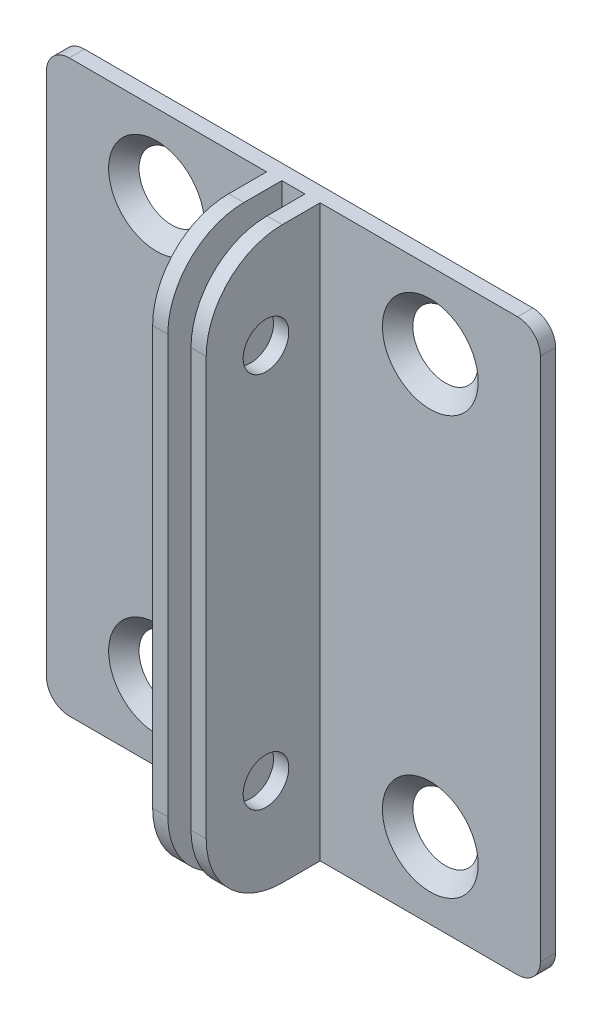
ISO-10303-21;
HEADER;
FILE_DESCRIPTION(('STEP AP214'),'2;1');
FILE_NAME('part.step','',(''),(''),'','','');
FILE_SCHEMA(('AUTOMOTIVE_DESIGN { 1 0 10303 214 1 1 1 1 }'));
ENDSEC;
DATA;
#1=APPLICATION_CONTEXT('core data for automotive mechanical design processes');
#2=APPLICATION_PROTOCOL_DEFINITION('international standard','automotive_design',2000,#1);
#3=PRODUCT_CONTEXT('',#1,'mechanical');
#4=PRODUCT('Part','Part','',(#3));
#5=PRODUCT_RELATED_PRODUCT_CATEGORY('part','',(#4));
#6=PRODUCT_DEFINITION_FORMATION('','',#4);
#7=PRODUCT_DEFINITION_CONTEXT('part definition',#1,'design');
#8=PRODUCT_DEFINITION('design','',#6,#7);
#9=PRODUCT_DEFINITION_SHAPE('','',#8);
#10=(LENGTH_UNIT() NAMED_UNIT(*) SI_UNIT(.MILLI.,.METRE.));
#11=(NAMED_UNIT(*) PLANE_ANGLE_UNIT() SI_UNIT($,.RADIAN.));
#12=(NAMED_UNIT(*) SI_UNIT($,.STERADIAN.) SOLID_ANGLE_UNIT());
#13=UNCERTAINTY_MEASURE_WITH_UNIT(LENGTH_MEASURE(1.E-05),#10,'distance_accuracy_value','');
#14=(GEOMETRIC_REPRESENTATION_CONTEXT(3) GLOBAL_UNCERTAINTY_ASSIGNED_CONTEXT((#13)) GLOBAL_UNIT_ASSIGNED_CONTEXT((#10,
#11,#12)) REPRESENTATION_CONTEXT('',''));
#15=CARTESIAN_POINT('',(0.,0.,0.));
#16=DIRECTION('',(0.,0.,1.));
#17=DIRECTION('',(1.,0.,0.));
#18=AXIS2_PLACEMENT_3D('',#15,#16,#17);
#19=CARTESIAN_POINT('',(0.,0.,0.));
#20=DIRECTION('',(0.,0.,-1.));
#21=DIRECTION('',(-1.,0.,0.));
#22=AXIS2_PLACEMENT_3D('',#19,#20,#21);
#23=PLANE('',#22);
#24=CARTESIAN_POINT('',(14.4883937482752,65.,0.));
#25=DIRECTION('',(0.,0.,-1.));
#26=DIRECTION('',(-1.,0.,0.));
#27=AXIS2_PLACEMENT_3D('',#24,#25,#26);
#28=CIRCLE('',#27,4.3);
#29=CARTESIAN_POINT('',(10.1883937482752,65.,0.));
#30=VERTEX_POINT('',#29);
#31=EDGE_CURVE('E350',#30,#30,#28,.T.);
#32=ORIENTED_EDGE('',*,*,#31,.F.);
#33=EDGE_LOOP('',(#32));
#34=FACE_BOUND('',#33,.T.);
#35=CARTESIAN_POINT('',(14.4883937482752,9.99999999999999,0.));
#36=DIRECTION('',(0.,0.,-1.));
#37=DIRECTION('',(-1.,0.,0.));
#38=AXIS2_PLACEMENT_3D('',#35,#36,#37);
#39=CIRCLE('',#38,4.3);
#40=CARTESIAN_POINT('',(10.1883937482752,9.99999999999999,0.));
#41=VERTEX_POINT('',#40);
#42=EDGE_CURVE('E255',#41,#41,#39,.T.);
#43=ORIENTED_EDGE('',*,*,#42,.F.);
#44=EDGE_LOOP('',(#43));
#45=FACE_BOUND('',#44,.T.);
#46=CARTESIAN_POINT('',(50.5116062517248,65.,0.));
#47=DIRECTION('',(0.,0.,-1.));
#48=DIRECTION('',(-1.,0.,0.));
#49=AXIS2_PLACEMENT_3D('',#46,#47,#48);
#50=CIRCLE('',#49,4.3);
#51=CARTESIAN_POINT('',(46.2116062517248,65.,0.));
#52=VERTEX_POINT('',#51);
#53=EDGE_CURVE('E318',#52,#52,#50,.T.);
#54=ORIENTED_EDGE('',*,*,#53,.F.);
#55=EDGE_LOOP('',(#54));
#56=FACE_BOUND('',#55,.T.);
#57=DIRECTION('',(0.,1.,0.));
#58=VECTOR('',#57,1.);
#59=CARTESIAN_POINT('',(65.,0.,0.));
#60=LINE('',#59,#58);
#61=CARTESIAN_POINT('',(65.,3.,0.));
#62=VERTEX_POINT('',#61);
#63=CARTESIAN_POINT('',(65.,72.,0.));
#64=VERTEX_POINT('',#63);
#65=EDGE_CURVE('E264',#62,#64,#60,.T.);
#66=ORIENTED_EDGE('',*,*,#65,.F.);
#67=CARTESIAN_POINT('',(62.,3.,0.));
#68=DIRECTION('',(0.,0.,-1.));
#69=DIRECTION('',(-1.,0.,0.));
#70=AXIS2_PLACEMENT_3D('',#67,#68,#69);
#71=CIRCLE('',#70,3.);
#72=CARTESIAN_POINT('',(62.,0.,0.));
#73=VERTEX_POINT('',#72);
#74=EDGE_CURVE('E252',#62,#73,#71,.T.);
#75=ORIENTED_EDGE('',*,*,#74,.T.);
#76=DIRECTION('',(1.,0.,0.));
#77=VECTOR('',#76,1.);
#78=CARTESIAN_POINT('',(0.,0.,0.));
#79=LINE('',#78,#77);
#80=CARTESIAN_POINT('',(3.,0.,0.));
#81=VERTEX_POINT('',#80);
#82=EDGE_CURVE('E248',#81,#73,#79,.T.);
#83=ORIENTED_EDGE('',*,*,#82,.F.);
#84=CARTESIAN_POINT('',(3.,3.,0.));
#85=DIRECTION('',(0.,0.,-1.));
#86=DIRECTION('',(-1.,0.,0.));
#87=AXIS2_PLACEMENT_3D('',#84,#85,#86);
#88=CIRCLE('',#87,3.);
#89=CARTESIAN_POINT('',(0.,3.,0.));
#90=VERTEX_POINT('',#89);
#91=EDGE_CURVE('E254',#81,#90,#88,.T.);
#92=ORIENTED_EDGE('',*,*,#91,.T.);
#93=DIRECTION('',(0.,-1.,0.));
#94=VECTOR('',#93,1.);
#95=CARTESIAN_POINT('',(0.,0.,0.));
#96=LINE('',#95,#94);
#97=CARTESIAN_POINT('',(0.,72.,0.));
#98=VERTEX_POINT('',#97);
#99=EDGE_CURVE('E233',#98,#90,#96,.T.);
#100=ORIENTED_EDGE('',*,*,#99,.F.);
#101=CARTESIAN_POINT('',(3.,72.,0.));
#102=DIRECTION('',(0.,0.,-1.));
#103=DIRECTION('',(-1.,0.,0.));
#104=AXIS2_PLACEMENT_3D('',#101,#102,#103);
#105=CIRCLE('',#104,3.);
#106=CARTESIAN_POINT('',(3.,75.,0.));
#107=VERTEX_POINT('',#106);
#108=EDGE_CURVE('E259',#98,#107,#105,.T.);
#109=ORIENTED_EDGE('',*,*,#108,.T.);
#110=DIRECTION('',(-1.,0.,0.));
#111=VECTOR('',#110,1.);
#112=CARTESIAN_POINT('',(0.,75.,0.));
#113=LINE('',#112,#111);
#114=CARTESIAN_POINT('',(62.,75.,0.));
#115=VERTEX_POINT('',#114);
#116=EDGE_CURVE('E206',#115,#107,#113,.T.);
#117=ORIENTED_EDGE('',*,*,#116,.F.);
#118=CARTESIAN_POINT('',(62.,72.,0.));
#119=DIRECTION('',(0.,0.,-1.));
#120=DIRECTION('',(-1.,0.,0.));
#121=AXIS2_PLACEMENT_3D('',#118,#119,#120);
#122=CIRCLE('',#121,3.);
#123=EDGE_CURVE('E256',#115,#64,#122,.T.);
#124=ORIENTED_EDGE('',*,*,#123,.T.);
#125=EDGE_LOOP('',(#66,#75,#83,#92,#100,#109,#117,#124));
#126=FACE_BOUND('',#125,.T.);
#127=CARTESIAN_POINT('',(50.5116062517248,9.99999999999999,0.));
#128=DIRECTION('',(0.,0.,-1.));
#129=DIRECTION('',(-1.,0.,0.));
#130=AXIS2_PLACEMENT_3D('',#127,#128,#129);
#131=CIRCLE('',#130,4.3);
#132=CARTESIAN_POINT('',(46.2116062517248,9.99999999999999,0.));
#133=VERTEX_POINT('',#132);
#134=EDGE_CURVE('E47',#133,#133,#131,.T.);
#135=ORIENTED_EDGE('',*,*,#134,.F.);
#136=EDGE_LOOP('',(#135));
#137=FACE_BOUND('',#136,.T.);
#138=ADVANCED_FACE('F38',(#34,#45,#56,#126,#137),#23,.T.);
#139=CARTESIAN_POINT('',(0.,0.,2.));
#140=DIRECTION('',(0.,0.,-1.));
#141=DIRECTION('',(-1.,0.,0.));
#142=AXIS2_PLACEMENT_3D('',#139,#140,#141);
#143=PLANE('',#142);
#144=DIRECTION('',(0.,1.,0.));
#145=VECTOR('',#144,1.);
#146=CARTESIAN_POINT('',(30.9767874965503,75.,2.));
#147=LINE('',#146,#145);
#148=CARTESIAN_POINT('',(30.9767874965503,0.,2.));
#149=VERTEX_POINT('',#148);
#150=CARTESIAN_POINT('',(30.9767874965503,75.,2.));
#151=VERTEX_POINT('',#150);
#152=EDGE_CURVE('E303',#149,#151,#147,.T.);
#153=ORIENTED_EDGE('',*,*,#152,.F.);
#154=DIRECTION('',(1.,0.,0.));
#155=VECTOR('',#154,1.);
#156=CARTESIAN_POINT('',(0.,0.,2.));
#157=LINE('',#156,#155);
#158=CARTESIAN_POINT('',(34.0232125034497,0.,2.));
#159=VERTEX_POINT('',#158);
#160=EDGE_CURVE('E258',#149,#159,#157,.T.);
#161=ORIENTED_EDGE('',*,*,#160,.T.);
#162=DIRECTION('',(0.,-1.,0.));
#163=VECTOR('',#162,1.);
#164=CARTESIAN_POINT('',(34.0232125034497,75.,2.));
#165=LINE('',#164,#163);
#166=CARTESIAN_POINT('',(34.0232125034497,75.,2.));
#167=VERTEX_POINT('',#166);
#168=EDGE_CURVE('E197',#167,#159,#165,.T.);
#169=ORIENTED_EDGE('',*,*,#168,.F.);
#170=DIRECTION('',(-1.,0.,0.));
#171=VECTOR('',#170,1.);
#172=CARTESIAN_POINT('',(0.,75.,2.));
#173=LINE('',#172,#171);
#174=EDGE_CURVE('E277',#167,#151,#173,.T.);
#175=ORIENTED_EDGE('',*,*,#174,.T.);
#176=EDGE_LOOP('',(#153,#161,#169,#175));
#177=FACE_BOUND('',#176,.T.);
#178=ADVANCED_FACE('F440',(#177),#143,.F.);
#179=CARTESIAN_POINT('',(14.4883937482752,65.,2.));
#180=DIRECTION('',(0.,0.,1.));
#181=DIRECTION('',(1.,0.,0.));
#182=AXIS2_PLACEMENT_3D('',#179,#180,#181);
#183=CIRCLE('',#182,6.3);
#184=CARTESIAN_POINT('',(20.7883937482752,65.,2.));
#185=VERTEX_POINT('',#184);
#186=EDGE_CURVE('E347',#185,#185,#183,.T.);
#187=ORIENTED_EDGE('',*,*,#186,.F.);
#188=EDGE_LOOP('',(#187));
#189=FACE_BOUND('',#188,.T.);
#190=CARTESIAN_POINT('',(14.4883937482752,9.99999999999999,2.));
#191=DIRECTION('',(0.,0.,1.));
#192=DIRECTION('',(1.,0.,0.));
#193=AXIS2_PLACEMENT_3D('',#190,#191,#192);
#194=CIRCLE('',#193,6.3);
#195=CARTESIAN_POINT('',(20.7883937482752,9.99999999999999,2.));
#196=VERTEX_POINT('',#195);
#197=EDGE_CURVE('E321',#196,#196,#194,.T.);
#198=ORIENTED_EDGE('',*,*,#197,.F.);
#199=EDGE_LOOP('',(#198));
#200=FACE_BOUND('',#199,.T.);
#201=DIRECTION('',(0.,-1.,0.));
#202=VECTOR('',#201,1.);
#203=CARTESIAN_POINT('',(0.,0.,2.));
#204=LINE('',#203,#202);
#205=CARTESIAN_POINT('',(0.,72.,2.));
#206=VERTEX_POINT('',#205);
#207=CARTESIAN_POINT('',(0.,3.,2.));
#208=VERTEX_POINT('',#207);
#209=EDGE_CURVE('E226',#206,#208,#204,.T.);
#210=ORIENTED_EDGE('',*,*,#209,.T.);
#211=CARTESIAN_POINT('',(3.,3.,2.));
#212=DIRECTION('',(0.,0.,-1.));
#213=DIRECTION('',(-1.,0.,0.));
#214=AXIS2_PLACEMENT_3D('',#211,#212,#213);
#215=CIRCLE('',#214,3.);
#216=CARTESIAN_POINT('',(3.,0.,2.));
#217=VERTEX_POINT('',#216);
#218=EDGE_CURVE('E223',#208,#217,#215,.F.);
#219=ORIENTED_EDGE('',*,*,#218,.T.);
#220=CARTESIAN_POINT('',(28.9767874965503,0.,2.));
#221=VERTEX_POINT('',#220);
#222=EDGE_CURVE('E225',#217,#221,#157,.T.);
#223=ORIENTED_EDGE('',*,*,#222,.T.);
#224=DIRECTION('',(0.,-1.,0.));
#225=VECTOR('',#224,1.);
#226=CARTESIAN_POINT('',(28.9767874965503,75.,2.));
#227=LINE('',#226,#225);
#228=CARTESIAN_POINT('',(28.9767874965503,75.,2.));
#229=VERTEX_POINT('',#228);
#230=EDGE_CURVE('E298',#229,#221,#227,.T.);
#231=ORIENTED_EDGE('',*,*,#230,.F.);
#232=CARTESIAN_POINT('',(3.,75.,2.));
#233=VERTEX_POINT('',#232);
#234=EDGE_CURVE('E230',#229,#233,#173,.T.);
#235=ORIENTED_EDGE('',*,*,#234,.T.);
#236=CARTESIAN_POINT('',(3.,72.,2.));
#237=DIRECTION('',(0.,0.,-1.));
#238=DIRECTION('',(-1.,0.,0.));
#239=AXIS2_PLACEMENT_3D('',#236,#237,#238);
#240=CIRCLE('',#239,3.);
#241=EDGE_CURVE('E227',#233,#206,#240,.F.);
#242=ORIENTED_EDGE('',*,*,#241,.T.);
#243=EDGE_LOOP('',(#210,#219,#223,#231,#235,#242));
#244=FACE_BOUND('',#243,.T.);
#245=ADVANCED_FACE('F400',(#189,#200,#244),#143,.F.);
#246=CARTESIAN_POINT('',(50.5116062517248,9.99999999999999,2.));
#247=DIRECTION('',(0.,0.,1.));
#248=DIRECTION('',(1.,0.,0.));
#249=AXIS2_PLACEMENT_3D('',#246,#247,#248);
#250=CIRCLE('',#249,6.3);
#251=CARTESIAN_POINT('',(56.8116062517248,9.99999999999999,2.));
#252=VERTEX_POINT('',#251);
#253=EDGE_CURVE('E11',#252,#252,#250,.T.);
#254=ORIENTED_EDGE('',*,*,#253,.F.);
#255=EDGE_LOOP('',(#254));
#256=FACE_BOUND('',#255,.T.);
#257=CARTESIAN_POINT('',(50.5116062517248,65.,2.));
#258=DIRECTION('',(0.,0.,1.));
#259=DIRECTION('',(1.,0.,0.));
#260=AXIS2_PLACEMENT_3D('',#257,#258,#259);
#261=CIRCLE('',#260,6.3);
#262=CARTESIAN_POINT('',(56.8116062517248,65.,2.));
#263=VERTEX_POINT('',#262);
#264=EDGE_CURVE('E316',#263,#263,#261,.T.);
#265=ORIENTED_EDGE('',*,*,#264,.F.);
#266=EDGE_LOOP('',(#265));
#267=FACE_BOUND('',#266,.T.);
#268=CARTESIAN_POINT('',(36.0232125034497,0.,2.));
#269=VERTEX_POINT('',#268);
#270=CARTESIAN_POINT('',(62.,0.,2.));
#271=VERTEX_POINT('',#270);
#272=EDGE_CURVE('E229',#269,#271,#157,.T.);
#273=ORIENTED_EDGE('',*,*,#272,.T.);
#274=CARTESIAN_POINT('',(62.,3.,2.));
#275=DIRECTION('',(0.,0.,-1.));
#276=DIRECTION('',(-1.,0.,0.));
#277=AXIS2_PLACEMENT_3D('',#274,#275,#276);
#278=CIRCLE('',#277,3.);
#279=CARTESIAN_POINT('',(65.,3.,2.));
#280=VERTEX_POINT('',#279);
#281=EDGE_CURVE('E239',#271,#280,#278,.F.);
#282=ORIENTED_EDGE('',*,*,#281,.T.);
#283=DIRECTION('',(0.,1.,0.));
#284=VECTOR('',#283,1.);
#285=CARTESIAN_POINT('',(65.,0.,2.));
#286=LINE('',#285,#284);
#287=CARTESIAN_POINT('',(65.,72.,2.));
#288=VERTEX_POINT('',#287);
#289=EDGE_CURVE('E241',#280,#288,#286,.T.);
#290=ORIENTED_EDGE('',*,*,#289,.T.);
#291=CARTESIAN_POINT('',(62.,72.,2.));
#292=DIRECTION('',(0.,0.,-1.));
#293=DIRECTION('',(-1.,0.,0.));
#294=AXIS2_PLACEMENT_3D('',#291,#292,#293);
#295=CIRCLE('',#294,3.);
#296=CARTESIAN_POINT('',(62.,75.,2.));
#297=VERTEX_POINT('',#296);
#298=EDGE_CURVE('E242',#288,#297,#295,.F.);
#299=ORIENTED_EDGE('',*,*,#298,.T.);
#300=CARTESIAN_POINT('',(36.0232125034497,75.,2.));
#301=VERTEX_POINT('',#300);
#302=EDGE_CURVE('E244',#297,#301,#173,.T.);
#303=ORIENTED_EDGE('',*,*,#302,.T.);
#304=DIRECTION('',(0.,1.,0.));
#305=VECTOR('',#304,1.);
#306=CARTESIAN_POINT('',(36.0232125034497,75.,2.));
#307=LINE('',#306,#305);
#308=EDGE_CURVE('E218',#269,#301,#307,.T.);
#309=ORIENTED_EDGE('',*,*,#308,.F.);
#310=EDGE_LOOP('',(#273,#282,#290,#299,#303,#309));
#311=FACE_BOUND('',#310,.T.);
#312=ADVANCED_FACE('F435',(#256,#267,#311),#143,.F.);
#313=CARTESIAN_POINT('',(0.,0.,2.));
#314=DIRECTION('',(1.,0.,0.));
#315=DIRECTION('',(0.,0.,-1.));
#316=AXIS2_PLACEMENT_3D('',#313,#314,#315);
#317=PLANE('',#316);
#318=ORIENTED_EDGE('',*,*,#99,.T.);
#319=DIRECTION('',(0.,0.,-1.));
#320=VECTOR('',#319,1.);
#321=CARTESIAN_POINT('',(0.,3.,2.));
#322=LINE('',#321,#320);
#323=EDGE_CURVE('E231',#90,#208,#322,.F.);
#324=ORIENTED_EDGE('',*,*,#323,.T.);
#325=ORIENTED_EDGE('',*,*,#209,.F.);
#326=DIRECTION('',(0.,0.,-1.));
#327=VECTOR('',#326,1.);
#328=CARTESIAN_POINT('',(0.,72.,2.));
#329=LINE('',#328,#327);
#330=EDGE_CURVE('E187',#206,#98,#329,.T.);
#331=ORIENTED_EDGE('',*,*,#330,.T.);
#332=EDGE_LOOP('',(#318,#324,#325,#331));
#333=FACE_BOUND('',#332,.T.);
#334=ADVANCED_FACE('F413',(#333),#317,.F.);
#335=CARTESIAN_POINT('',(0.,0.,2.));
#336=DIRECTION('',(0.,1.,0.));
#337=DIRECTION('',(0.,0.,1.));
#338=AXIS2_PLACEMENT_3D('',#335,#336,#337);
#339=PLANE('',#338);
#340=DIRECTION('',(0.,0.,-1.));
#341=VECTOR('',#340,1.);
#342=CARTESIAN_POINT('',(36.0232125034497,0.,17.));
#343=LINE('',#342,#341);
#344=CARTESIAN_POINT('',(36.0232125034497,0.,7.));
#345=VERTEX_POINT('',#344);
#346=EDGE_CURVE('E185',#345,#269,#343,.T.);
#347=ORIENTED_EDGE('',*,*,#346,.F.);
#348=DIRECTION('',(1.,0.,0.));
#349=VECTOR('',#348,1.);
#350=CARTESIAN_POINT('',(34.0232125034497,0.,7.));
#351=LINE('',#350,#349);
#352=CARTESIAN_POINT('',(34.0232125034497,0.,7.));
#353=VERTEX_POINT('',#352);
#354=EDGE_CURVE('E178',#345,#353,#351,.F.);
#355=ORIENTED_EDGE('',*,*,#354,.T.);
#356=DIRECTION('',(0.,0.,-1.));
#357=VECTOR('',#356,1.);
#358=CARTESIAN_POINT('',(34.0232125034497,0.,17.));
#359=LINE('',#358,#357);
#360=EDGE_CURVE('E182',#353,#159,#359,.T.);
#361=ORIENTED_EDGE('',*,*,#360,.T.);
#362=ORIENTED_EDGE('',*,*,#160,.F.);
#363=DIRECTION('',(0.,0.,-1.));
#364=VECTOR('',#363,1.);
#365=CARTESIAN_POINT('',(30.9767874965503,0.,17.));
#366=LINE('',#365,#364);
#367=CARTESIAN_POINT('',(30.9767874965503,0.,7.));
#368=VERTEX_POINT('',#367);
#369=EDGE_CURVE('E301',#368,#149,#366,.T.);
#370=ORIENTED_EDGE('',*,*,#369,.F.);
#371=DIRECTION('',(1.,0.,0.));
#372=VECTOR('',#371,1.);
#373=CARTESIAN_POINT('',(0.,0.,7.));
#374=LINE('',#373,#372);
#375=CARTESIAN_POINT('',(28.9767874965503,0.,7.));
#376=VERTEX_POINT('',#375);
#377=EDGE_CURVE('E198',#368,#376,#374,.F.);
#378=ORIENTED_EDGE('',*,*,#377,.T.);
#379=DIRECTION('',(0.,0.,-1.));
#380=VECTOR('',#379,1.);
#381=CARTESIAN_POINT('',(28.9767874965503,0.,17.));
#382=LINE('',#381,#380);
#383=EDGE_CURVE('E213',#376,#221,#382,.T.);
#384=ORIENTED_EDGE('',*,*,#383,.T.);
#385=ORIENTED_EDGE('',*,*,#222,.F.);
#386=DIRECTION('',(0.,0.,-1.));
#387=VECTOR('',#386,1.);
#388=CARTESIAN_POINT('',(3.,0.,2.));
#389=LINE('',#388,#387);
#390=EDGE_CURVE('E249',#217,#81,#389,.T.);
#391=ORIENTED_EDGE('',*,*,#390,.T.);
#392=ORIENTED_EDGE('',*,*,#82,.T.);
#393=DIRECTION('',(0.,0.,-1.));
#394=VECTOR('',#393,1.);
#395=CARTESIAN_POINT('',(62.,0.,2.));
#396=LINE('',#395,#394);
#397=EDGE_CURVE('E245',#73,#271,#396,.F.);
#398=ORIENTED_EDGE('',*,*,#397,.T.);
#399=ORIENTED_EDGE('',*,*,#272,.F.);
#400=EDGE_LOOP('',(#347,#355,#361,#362,#370,#378,#384,#385,#391,#392,#398,#399));
#401=FACE_BOUND('',#400,.T.);
#402=ADVANCED_FACE('F180',(#401),#339,.F.);
#403=CARTESIAN_POINT('',(65.,0.,2.));
#404=DIRECTION('',(-1.,0.,0.));
#405=DIRECTION('',(0.,0.,1.));
#406=AXIS2_PLACEMENT_3D('',#403,#404,#405);
#407=PLANE('',#406);
#408=ORIENTED_EDGE('',*,*,#289,.F.);
#409=DIRECTION('',(0.,0.,-1.));
#410=VECTOR('',#409,1.);
#411=CARTESIAN_POINT('',(65.,3.,2.));
#412=LINE('',#411,#410);
#413=EDGE_CURVE('E247',#280,#62,#412,.T.);
#414=ORIENTED_EDGE('',*,*,#413,.T.);
#415=ORIENTED_EDGE('',*,*,#65,.T.);
#416=DIRECTION('',(0.,0.,-1.));
#417=VECTOR('',#416,1.);
#418=CARTESIAN_POINT('',(65.,72.,2.));
#419=LINE('',#418,#417);
#420=EDGE_CURVE('E265',#64,#288,#419,.F.);
#421=ORIENTED_EDGE('',*,*,#420,.T.);
#422=EDGE_LOOP('',(#408,#414,#415,#421));
#423=FACE_BOUND('',#422,.T.);
#424=ADVANCED_FACE('F426',(#423),#407,.F.);
#425=CARTESIAN_POINT('',(0.,75.,2.));
#426=DIRECTION('',(0.,-1.,0.));
#427=DIRECTION('',(0.,0.,-1.));
#428=AXIS2_PLACEMENT_3D('',#425,#426,#427);
#429=PLANE('',#428);
#430=DIRECTION('',(0.,0.,-1.));
#431=VECTOR('',#430,1.);
#432=CARTESIAN_POINT('',(28.9767874965503,75.,17.));
#433=LINE('',#432,#431);
#434=CARTESIAN_POINT('',(28.9767874965503,75.,7.));
#435=VERTEX_POINT('',#434);
#436=EDGE_CURVE('E295',#435,#229,#433,.T.);
#437=ORIENTED_EDGE('',*,*,#436,.F.);
#438=DIRECTION('',(-1.,0.,0.));
#439=VECTOR('',#438,1.);
#440=CARTESIAN_POINT('',(0.,75.,7.));
#441=LINE('',#440,#439);
#442=CARTESIAN_POINT('',(30.9767874965503,75.,7.));
#443=VERTEX_POINT('',#442);
#444=EDGE_CURVE('E267',#435,#443,#441,.F.);
#445=ORIENTED_EDGE('',*,*,#444,.T.);
#446=DIRECTION('',(0.,0.,-1.));
#447=VECTOR('',#446,1.);
#448=CARTESIAN_POINT('',(30.9767874965503,75.,17.));
#449=LINE('',#448,#447);
#450=EDGE_CURVE('E293',#443,#151,#449,.T.);
#451=ORIENTED_EDGE('',*,*,#450,.T.);
#452=ORIENTED_EDGE('',*,*,#174,.F.);
#453=DIRECTION('',(0.,0.,-1.));
#454=VECTOR('',#453,1.);
#455=CARTESIAN_POINT('',(34.0232125034497,75.,17.));
#456=LINE('',#455,#454);
#457=CARTESIAN_POINT('',(34.0232125034497,75.,7.));
#458=VERTEX_POINT('',#457);
#459=EDGE_CURVE('E204',#458,#167,#456,.T.);
#460=ORIENTED_EDGE('',*,*,#459,.F.);
#461=DIRECTION('',(-1.,0.,0.));
#462=VECTOR('',#461,1.);
#463=CARTESIAN_POINT('',(36.0232125034497,75.,7.));
#464=LINE('',#463,#462);
#465=CARTESIAN_POINT('',(36.0232125034497,75.,7.));
#466=VERTEX_POINT('',#465);
#467=EDGE_CURVE('E150',#458,#466,#464,.F.);
#468=ORIENTED_EDGE('',*,*,#467,.T.);
#469=DIRECTION('',(0.,0.,-1.));
#470=VECTOR('',#469,1.);
#471=CARTESIAN_POINT('',(36.0232125034497,75.,17.));
#472=LINE('',#471,#470);
#473=EDGE_CURVE('E146',#466,#301,#472,.T.);
#474=ORIENTED_EDGE('',*,*,#473,.T.);
#475=ORIENTED_EDGE('',*,*,#302,.F.);
#476=DIRECTION('',(0.,0.,-1.));
#477=VECTOR('',#476,1.);
#478=CARTESIAN_POINT('',(62.,75.,2.));
#479=LINE('',#478,#477);
#480=EDGE_CURVE('E236',#297,#115,#479,.T.);
#481=ORIENTED_EDGE('',*,*,#480,.T.);
#482=ORIENTED_EDGE('',*,*,#116,.T.);
#483=DIRECTION('',(0.,0.,-1.));
#484=VECTOR('',#483,1.);
#485=CARTESIAN_POINT('',(3.,75.,2.));
#486=LINE('',#485,#484);
#487=EDGE_CURVE('E202',#107,#233,#486,.F.);
#488=ORIENTED_EDGE('',*,*,#487,.T.);
#489=ORIENTED_EDGE('',*,*,#234,.F.);
#490=EDGE_LOOP('',(#437,#445,#451,#452,#460,#468,#474,#475,#481,#482,#488,#489));
#491=FACE_BOUND('',#490,.T.);
#492=ADVANCED_FACE('F396',(#491),#429,.F.);
#493=CARTESIAN_POINT('',(34.0232125034497,75.,17.));
#494=DIRECTION('',(1.,0.,0.));
#495=DIRECTION('',(0.,0.,-1.));
#496=AXIS2_PLACEMENT_3D('',#493,#494,#495);
#497=PLANE('',#496);
#498=CARTESIAN_POINT('',(34.0232125034497,62.3122140243295,9.1337107707589));
#499=DIRECTION('',(1.,0.,0.));
#500=DIRECTION('',(0.,0.,-1.));
#501=AXIS2_PLACEMENT_3D('',#498,#499,#500);
#502=CIRCLE('',#501,3.);
#503=CARTESIAN_POINT('',(34.0232125034497,62.3122140243295,6.13371077075891));
#504=VERTEX_POINT('',#503);
#505=EDGE_CURVE('E344',#504,#504,#502,.T.);
#506=ORIENTED_EDGE('',*,*,#505,.T.);
#507=EDGE_LOOP('',(#506));
#508=FACE_BOUND('',#507,.T.);
#509=CARTESIAN_POINT('',(34.0232125034497,12.6877859756705,9.13371077075888));
#510=DIRECTION('',(1.,0.,0.));
#511=DIRECTION('',(0.,0.,-1.));
#512=AXIS2_PLACEMENT_3D('',#509,#510,#511);
#513=CIRCLE('',#512,3.);
#514=CARTESIAN_POINT('',(34.0232125034497,12.6877859756705,6.13371077075888));
#515=VERTEX_POINT('',#514);
#516=EDGE_CURVE('E329',#515,#515,#513,.T.);
#517=ORIENTED_EDGE('',*,*,#516,.T.);
#518=EDGE_LOOP('',(#517));
#519=FACE_BOUND('',#518,.T.);
#520=ORIENTED_EDGE('',*,*,#360,.F.);
#521=CARTESIAN_POINT('',(34.0232125034497,10.,7.));
#522=DIRECTION('',(1.,0.,0.));
#523=DIRECTION('',(0.,0.,-1.));
#524=AXIS2_PLACEMENT_3D('',#521,#522,#523);
#525=CIRCLE('',#524,10.);
#526=CARTESIAN_POINT('',(34.0232125034497,9.99999999999999,17.));
#527=VERTEX_POINT('',#526);
#528=EDGE_CURVE('E194',#353,#527,#525,.F.);
#529=ORIENTED_EDGE('',*,*,#528,.T.);
#530=DIRECTION('',(0.,-1.,0.));
#531=VECTOR('',#530,1.);
#532=CARTESIAN_POINT('',(34.0232125034497,75.,17.));
#533=LINE('',#532,#531);
#534=CARTESIAN_POINT('',(34.0232125034497,65.,17.));
#535=VERTEX_POINT('',#534);
#536=EDGE_CURVE('E217',#535,#527,#533,.T.);
#537=ORIENTED_EDGE('',*,*,#536,.F.);
#538=CARTESIAN_POINT('',(34.0232125034497,65.,7.));
#539=DIRECTION('',(1.,0.,0.));
#540=DIRECTION('',(0.,0.,-1.));
#541=AXIS2_PLACEMENT_3D('',#538,#539,#540);
#542=CIRCLE('',#541,10.);
#543=EDGE_CURVE('E56',#535,#458,#542,.F.);
#544=ORIENTED_EDGE('',*,*,#543,.T.);
#545=ORIENTED_EDGE('',*,*,#459,.T.);
#546=ORIENTED_EDGE('',*,*,#168,.T.);
#547=EDGE_LOOP('',(#520,#529,#537,#544,#545,#546));
#548=FACE_BOUND('',#547,.T.);
#549=ADVANCED_FACE('F192',(#508,#519,#548),#497,.F.);
#550=CARTESIAN_POINT('',(36.0232125034497,75.,17.));
#551=DIRECTION('',(-1.,0.,0.));
#552=DIRECTION('',(0.,-1.,0.));
#553=AXIS2_PLACEMENT_3D('',#550,#551,#552);
#554=PLANE('',#553);
#555=CARTESIAN_POINT('',(36.0232125034497,62.3122140243295,9.1337107707589));
#556=DIRECTION('',(1.,0.,0.));
#557=DIRECTION('',(0.,1.,0.));
#558=AXIS2_PLACEMENT_3D('',#555,#556,#557);
#559=CIRCLE('',#558,3.);
#560=CARTESIAN_POINT('',(36.0232125034497,65.3122140243295,9.1337107707589));
#561=VERTEX_POINT('',#560);
#562=EDGE_CURVE('E325',#561,#561,#559,.T.);
#563=ORIENTED_EDGE('',*,*,#562,.F.);
#564=EDGE_LOOP('',(#563));
#565=FACE_BOUND('',#564,.T.);
#566=CARTESIAN_POINT('',(36.0232125034497,12.6877859756705,9.13371077075888));
#567=DIRECTION('',(1.,0.,0.));
#568=DIRECTION('',(0.,-1.,0.));
#569=AXIS2_PLACEMENT_3D('',#566,#567,#568);
#570=CIRCLE('',#569,3.);
#571=CARTESIAN_POINT('',(36.0232125034497,9.68778597567051,9.13371077075888));
#572=VERTEX_POINT('',#571);
#573=EDGE_CURVE('E332',#572,#572,#570,.T.);
#574=ORIENTED_EDGE('',*,*,#573,.F.);
#575=EDGE_LOOP('',(#574));
#576=FACE_BOUND('',#575,.T.);
#577=DIRECTION('',(0.,1.,0.));
#578=VECTOR('',#577,1.);
#579=CARTESIAN_POINT('',(36.0232125034497,75.,17.));
#580=LINE('',#579,#578);
#581=CARTESIAN_POINT('',(36.0232125034497,9.99999999999999,17.));
#582=VERTEX_POINT('',#581);
#583=CARTESIAN_POINT('',(36.0232125034497,65.,17.));
#584=VERTEX_POINT('',#583);
#585=EDGE_CURVE('E220',#582,#584,#580,.T.);
#586=ORIENTED_EDGE('',*,*,#585,.F.);
#587=CARTESIAN_POINT('',(36.0232125034497,10.,7.));
#588=DIRECTION('',(-1.,0.,0.));
#589=DIRECTION('',(0.,-1.,0.));
#590=AXIS2_PLACEMENT_3D('',#587,#588,#589);
#591=CIRCLE('',#590,10.);
#592=EDGE_CURVE('E160',#582,#345,#591,.F.);
#593=ORIENTED_EDGE('',*,*,#592,.T.);
#594=ORIENTED_EDGE('',*,*,#346,.T.);
#595=ORIENTED_EDGE('',*,*,#308,.T.);
#596=ORIENTED_EDGE('',*,*,#473,.F.);
#597=CARTESIAN_POINT('',(36.0232125034497,65.,7.));
#598=DIRECTION('',(-1.,0.,0.));
#599=DIRECTION('',(0.,-1.,0.));
#600=AXIS2_PLACEMENT_3D('',#597,#598,#599);
#601=CIRCLE('',#600,10.);
#602=EDGE_CURVE('E215',#466,#584,#601,.F.);
#603=ORIENTED_EDGE('',*,*,#602,.T.);
#604=EDGE_LOOP('',(#586,#593,#594,#595,#596,#603));
#605=FACE_BOUND('',#604,.T.);
#606=ADVANCED_FACE('F484',(#565,#576,#605),#554,.F.);
#607=CARTESIAN_POINT('',(0.,0.,17.));
#608=DIRECTION('',(0.,0.,1.));
#609=DIRECTION('',(1.,0.,0.));
#610=AXIS2_PLACEMENT_3D('',#607,#608,#609);
#611=PLANE('',#610);
#612=ORIENTED_EDGE('',*,*,#536,.T.);
#613=DIRECTION('',(1.,0.,0.));
#614=VECTOR('',#613,1.);
#615=CARTESIAN_POINT('',(36.0232125034497,10.,17.));
#616=LINE('',#615,#614);
#617=EDGE_CURVE('E201',#527,#582,#616,.T.);
#618=ORIENTED_EDGE('',*,*,#617,.T.);
#619=ORIENTED_EDGE('',*,*,#585,.T.);
#620=DIRECTION('',(-1.,0.,0.));
#621=VECTOR('',#620,1.);
#622=CARTESIAN_POINT('',(34.0232125034497,65.,17.));
#623=LINE('',#622,#621);
#624=EDGE_CURVE('E221',#584,#535,#623,.T.);
#625=ORIENTED_EDGE('',*,*,#624,.T.);
#626=EDGE_LOOP('',(#612,#618,#619,#625));
#627=FACE_BOUND('',#626,.T.);
#628=ADVANCED_FACE('F488',(#627),#611,.T.);
#629=CARTESIAN_POINT('',(30.9767874965503,75.,17.));
#630=DIRECTION('',(-1.,0.,0.));
#631=DIRECTION('',(0.,0.,1.));
#632=AXIS2_PLACEMENT_3D('',#629,#630,#631);
#633=PLANE('',#632);
#634=CARTESIAN_POINT('',(30.9767874965503,62.3122140243295,9.1337107707589));
#635=DIRECTION('',(-1.,0.,0.));
#636=DIRECTION('',(0.,0.,1.));
#637=AXIS2_PLACEMENT_3D('',#634,#635,#636);
#638=CIRCLE('',#637,3.);
#639=CARTESIAN_POINT('',(30.9767874965503,62.3122140243295,12.1337107707589));
#640=VERTEX_POINT('',#639);
#641=EDGE_CURVE('E341',#640,#640,#638,.T.);
#642=ORIENTED_EDGE('',*,*,#641,.T.);
#643=EDGE_LOOP('',(#642));
#644=FACE_BOUND('',#643,.T.);
#645=CARTESIAN_POINT('',(30.9767874965503,12.6877859756705,9.13371077075888));
#646=DIRECTION('',(-1.,0.,0.));
#647=DIRECTION('',(0.,0.,1.));
#648=AXIS2_PLACEMENT_3D('',#645,#646,#647);
#649=CIRCLE('',#648,3.);
#650=CARTESIAN_POINT('',(30.9767874965503,12.6877859756705,12.1337107707589));
#651=VERTEX_POINT('',#650);
#652=EDGE_CURVE('E324',#651,#651,#649,.T.);
#653=ORIENTED_EDGE('',*,*,#652,.T.);
#654=EDGE_LOOP('',(#653));
#655=FACE_BOUND('',#654,.T.);
#656=DIRECTION('',(0.,1.,0.));
#657=VECTOR('',#656,1.);
#658=CARTESIAN_POINT('',(30.9767874965503,75.,17.));
#659=LINE('',#658,#657);
#660=CARTESIAN_POINT('',(30.9767874965503,9.99999999999999,17.));
#661=VERTEX_POINT('',#660);
#662=CARTESIAN_POINT('',(30.9767874965503,65.,17.));
#663=VERTEX_POINT('',#662);
#664=EDGE_CURVE('E313',#661,#663,#659,.T.);
#665=ORIENTED_EDGE('',*,*,#664,.F.);
#666=CARTESIAN_POINT('',(30.9767874965503,10.,7.));
#667=DIRECTION('',(-1.,0.,0.));
#668=DIRECTION('',(0.,0.,1.));
#669=AXIS2_PLACEMENT_3D('',#666,#667,#668);
#670=CIRCLE('',#669,10.);
#671=EDGE_CURVE('E168',#661,#368,#670,.F.);
#672=ORIENTED_EDGE('',*,*,#671,.T.);
#673=ORIENTED_EDGE('',*,*,#369,.T.);
#674=ORIENTED_EDGE('',*,*,#152,.T.);
#675=ORIENTED_EDGE('',*,*,#450,.F.);
#676=CARTESIAN_POINT('',(30.9767874965503,65.,7.));
#677=DIRECTION('',(-1.,0.,0.));
#678=DIRECTION('',(0.,0.,1.));
#679=AXIS2_PLACEMENT_3D('',#676,#677,#678);
#680=CIRCLE('',#679,10.);
#681=EDGE_CURVE('E309',#443,#663,#680,.F.);
#682=ORIENTED_EDGE('',*,*,#681,.T.);
#683=EDGE_LOOP('',(#665,#672,#673,#674,#675,#682));
#684=FACE_BOUND('',#683,.T.);
#685=ADVANCED_FACE('F378',(#644,#655,#684),#633,.F.);
#686=CARTESIAN_POINT('',(28.9767874965503,75.,17.));
#687=DIRECTION('',(1.,0.,0.));
#688=DIRECTION('',(0.,1.,0.));
#689=AXIS2_PLACEMENT_3D('',#686,#687,#688);
#690=PLANE('',#689);
#691=CARTESIAN_POINT('',(28.9767874965503,62.3122140243295,9.1337107707589));
#692=DIRECTION('',(1.,0.,0.));
#693=DIRECTION('',(0.,1.,0.));
#694=AXIS2_PLACEMENT_3D('',#691,#692,#693);
#695=CIRCLE('',#694,3.);
#696=CARTESIAN_POINT('',(28.9767874965503,65.3122140243295,9.1337107707589));
#697=VERTEX_POINT('',#696);
#698=EDGE_CURVE('E41',#697,#697,#695,.T.);
#699=ORIENTED_EDGE('',*,*,#698,.T.);
#700=EDGE_LOOP('',(#699));
#701=FACE_BOUND('',#700,.T.);
#702=CARTESIAN_POINT('',(28.9767874965503,12.6877859756705,9.13371077075888));
#703=DIRECTION('',(1.,0.,0.));
#704=DIRECTION('',(0.,1.,0.));
#705=AXIS2_PLACEMENT_3D('',#702,#703,#704);
#706=CIRCLE('',#705,3.);
#707=CARTESIAN_POINT('',(28.9767874965503,15.6877859756705,9.13371077075888));
#708=VERTEX_POINT('',#707);
#709=EDGE_CURVE('E322',#708,#708,#706,.T.);
#710=ORIENTED_EDGE('',*,*,#709,.T.);
#711=EDGE_LOOP('',(#710));
#712=FACE_BOUND('',#711,.T.);
#713=ORIENTED_EDGE('',*,*,#383,.F.);
#714=CARTESIAN_POINT('',(28.9767874965503,10.,7.));
#715=DIRECTION('',(1.,0.,0.));
#716=DIRECTION('',(0.,1.,0.));
#717=AXIS2_PLACEMENT_3D('',#714,#715,#716);
#718=CIRCLE('',#717,10.);
#719=CARTESIAN_POINT('',(28.9767874965503,9.99999999999999,17.));
#720=VERTEX_POINT('',#719);
#721=EDGE_CURVE('E362',#376,#720,#718,.F.);
#722=ORIENTED_EDGE('',*,*,#721,.T.);
#723=DIRECTION('',(0.,-1.,0.));
#724=VECTOR('',#723,1.);
#725=CARTESIAN_POINT('',(28.9767874965503,75.,17.));
#726=LINE('',#725,#724);
#727=CARTESIAN_POINT('',(28.9767874965503,65.,17.));
#728=VERTEX_POINT('',#727);
#729=EDGE_CURVE('E306',#728,#720,#726,.T.);
#730=ORIENTED_EDGE('',*,*,#729,.F.);
#731=CARTESIAN_POINT('',(28.9767874965503,65.,7.));
#732=DIRECTION('',(1.,0.,0.));
#733=DIRECTION('',(0.,1.,0.));
#734=AXIS2_PLACEMENT_3D('',#731,#732,#733);
#735=CIRCLE('',#734,10.);
#736=EDGE_CURVE('E299',#728,#435,#735,.F.);
#737=ORIENTED_EDGE('',*,*,#736,.T.);
#738=ORIENTED_EDGE('',*,*,#436,.T.);
#739=ORIENTED_EDGE('',*,*,#230,.T.);
#740=EDGE_LOOP('',(#713,#722,#730,#737,#738,#739));
#741=FACE_BOUND('',#740,.T.);
#742=ADVANCED_FACE('F393',(#701,#712,#741),#690,.F.);
#743=CARTESIAN_POINT('',(0.,0.,17.));
#744=DIRECTION('',(0.,0.,-1.));
#745=DIRECTION('',(-1.,0.,0.));
#746=AXIS2_PLACEMENT_3D('',#743,#744,#745);
#747=PLANE('',#746);
#748=ORIENTED_EDGE('',*,*,#729,.T.);
#749=DIRECTION('',(1.,0.,0.));
#750=VECTOR('',#749,1.);
#751=CARTESIAN_POINT('',(0.,10.,17.));
#752=LINE('',#751,#750);
#753=EDGE_CURVE('E312',#720,#661,#752,.T.);
#754=ORIENTED_EDGE('',*,*,#753,.T.);
#755=ORIENTED_EDGE('',*,*,#664,.T.);
#756=DIRECTION('',(-1.,0.,0.));
#757=VECTOR('',#756,1.);
#758=CARTESIAN_POINT('',(0.,65.,17.));
#759=LINE('',#758,#757);
#760=EDGE_CURVE('E209',#663,#728,#759,.T.);
#761=ORIENTED_EDGE('',*,*,#760,.T.);
#762=EDGE_LOOP('',(#748,#754,#755,#761));
#763=FACE_BOUND('',#762,.T.);
#764=ADVANCED_FACE('F371',(#763),#747,.F.);
#765=CARTESIAN_POINT('',(62.,3.,2.));
#766=DIRECTION('',(0.,0.,-1.));
#767=DIRECTION('',(-1.,0.,0.));
#768=AXIS2_PLACEMENT_3D('',#765,#766,#767);
#769=CYLINDRICAL_SURFACE('',#768,3.);
#770=ORIENTED_EDGE('',*,*,#281,.F.);
#771=ORIENTED_EDGE('',*,*,#397,.F.);
#772=ORIENTED_EDGE('',*,*,#74,.F.);
#773=ORIENTED_EDGE('',*,*,#413,.F.);
#774=EDGE_LOOP('',(#770,#771,#772,#773));
#775=FACE_BOUND('',#774,.T.);
#776=ADVANCED_FACE('F430',(#775),#769,.T.);
#777=CARTESIAN_POINT('',(62.,72.,2.));
#778=DIRECTION('',(0.,0.,-1.));
#779=DIRECTION('',(-1.,0.,0.));
#780=AXIS2_PLACEMENT_3D('',#777,#778,#779);
#781=CYLINDRICAL_SURFACE('',#780,3.);
#782=ORIENTED_EDGE('',*,*,#298,.F.);
#783=ORIENTED_EDGE('',*,*,#420,.F.);
#784=ORIENTED_EDGE('',*,*,#123,.F.);
#785=ORIENTED_EDGE('',*,*,#480,.F.);
#786=EDGE_LOOP('',(#782,#783,#784,#785));
#787=FACE_BOUND('',#786,.T.);
#788=ADVANCED_FACE('F422',(#787),#781,.T.);
#789=CARTESIAN_POINT('',(3.,3.,2.));
#790=DIRECTION('',(0.,0.,-1.));
#791=DIRECTION('',(-1.,0.,0.));
#792=AXIS2_PLACEMENT_3D('',#789,#790,#791);
#793=CYLINDRICAL_SURFACE('',#792,3.);
#794=ORIENTED_EDGE('',*,*,#218,.F.);
#795=ORIENTED_EDGE('',*,*,#323,.F.);
#796=ORIENTED_EDGE('',*,*,#91,.F.);
#797=ORIENTED_EDGE('',*,*,#390,.F.);
#798=EDGE_LOOP('',(#794,#795,#796,#797));
#799=FACE_BOUND('',#798,.T.);
#800=ADVANCED_FACE('F406',(#799),#793,.T.);
#801=CARTESIAN_POINT('',(3.,72.,2.));
#802=DIRECTION('',(0.,0.,-1.));
#803=DIRECTION('',(-1.,0.,0.));
#804=AXIS2_PLACEMENT_3D('',#801,#802,#803);
#805=CYLINDRICAL_SURFACE('',#804,3.);
#806=ORIENTED_EDGE('',*,*,#241,.F.);
#807=ORIENTED_EDGE('',*,*,#487,.F.);
#808=ORIENTED_EDGE('',*,*,#108,.F.);
#809=ORIENTED_EDGE('',*,*,#330,.F.);
#810=EDGE_LOOP('',(#806,#807,#808,#809));
#811=FACE_BOUND('',#810,.T.);
#812=ADVANCED_FACE('F417',(#811),#805,.T.);
#813=CARTESIAN_POINT('',(0.,10.,7.));
#814=DIRECTION('',(-1.,0.,0.));
#815=DIRECTION('',(0.,0.,1.));
#816=AXIS2_PLACEMENT_3D('',#813,#814,#815);
#817=CYLINDRICAL_SURFACE('',#816,10.);
#818=ORIENTED_EDGE('',*,*,#528,.F.);
#819=ORIENTED_EDGE('',*,*,#354,.F.);
#820=ORIENTED_EDGE('',*,*,#592,.F.);
#821=ORIENTED_EDGE('',*,*,#617,.F.);
#822=EDGE_LOOP('',(#818,#819,#820,#821));
#823=FACE_BOUND('',#822,.T.);
#824=ADVANCED_FACE('F200',(#823),#817,.T.);
#825=CARTESIAN_POINT('',(0.,10.,7.));
#826=DIRECTION('',(1.,0.,0.));
#827=DIRECTION('',(0.,0.,-1.));
#828=AXIS2_PLACEMENT_3D('',#825,#826,#827);
#829=CYLINDRICAL_SURFACE('',#828,10.);
#830=ORIENTED_EDGE('',*,*,#721,.F.);
#831=ORIENTED_EDGE('',*,*,#377,.F.);
#832=ORIENTED_EDGE('',*,*,#671,.F.);
#833=ORIENTED_EDGE('',*,*,#753,.F.);
#834=EDGE_LOOP('',(#830,#831,#832,#833));
#835=FACE_BOUND('',#834,.T.);
#836=ADVANCED_FACE('F441',(#835),#829,.T.);
#837=CARTESIAN_POINT('',(0.,65.,7.));
#838=DIRECTION('',(-1.,0.,0.));
#839=DIRECTION('',(0.,0.,1.));
#840=AXIS2_PLACEMENT_3D('',#837,#838,#839);
#841=CYLINDRICAL_SURFACE('',#840,10.);
#842=ORIENTED_EDGE('',*,*,#681,.F.);
#843=ORIENTED_EDGE('',*,*,#444,.F.);
#844=ORIENTED_EDGE('',*,*,#736,.F.);
#845=ORIENTED_EDGE('',*,*,#760,.F.);
#846=EDGE_LOOP('',(#842,#843,#844,#845));
#847=FACE_BOUND('',#846,.T.);
#848=ADVANCED_FACE('F384',(#847),#841,.T.);
#849=CARTESIAN_POINT('',(0.,65.,7.));
#850=DIRECTION('',(1.,0.,0.));
#851=DIRECTION('',(0.,0.,-1.));
#852=AXIS2_PLACEMENT_3D('',#849,#850,#851);
#853=CYLINDRICAL_SURFACE('',#852,10.);
#854=ORIENTED_EDGE('',*,*,#602,.F.);
#855=ORIENTED_EDGE('',*,*,#467,.F.);
#856=ORIENTED_EDGE('',*,*,#543,.F.);
#857=ORIENTED_EDGE('',*,*,#624,.F.);
#858=EDGE_LOOP('',(#854,#855,#856,#857));
#859=FACE_BOUND('',#858,.T.);
#860=ADVANCED_FACE('F448',(#859),#853,.T.);
#861=CARTESIAN_POINT('',(50.5116062517248,65.,2.));
#862=DIRECTION('',(0.,0.,1.));
#863=DIRECTION('',(1.,0.,0.));
#864=AXIS2_PLACEMENT_3D('',#861,#862,#863);
#865=CONICAL_SURFACE('',#864,6.3,0.785398163397449);
#866=ORIENTED_EDGE('',*,*,#53,.T.);
#867=EDGE_LOOP('',(#866));
#868=FACE_BOUND('',#867,.T.);
#869=ORIENTED_EDGE('',*,*,#264,.T.);
#870=EDGE_LOOP('',(#869));
#871=FACE_BOUND('',#870,.T.);
#872=ADVANCED_FACE('F463',(#868,#871),#865,.F.);
#873=CARTESIAN_POINT('',(50.5116062517248,9.99999999999999,2.));
#874=DIRECTION('',(0.,0.,1.));
#875=DIRECTION('',(1.,0.,0.));
#876=AXIS2_PLACEMENT_3D('',#873,#874,#875);
#877=CONICAL_SURFACE('',#876,6.3,0.785398163397449);
#878=ORIENTED_EDGE('',*,*,#134,.T.);
#879=EDGE_LOOP('',(#878));
#880=FACE_BOUND('',#879,.T.);
#881=ORIENTED_EDGE('',*,*,#253,.T.);
#882=EDGE_LOOP('',(#881));
#883=FACE_BOUND('',#882,.T.);
#884=ADVANCED_FACE('F466',(#880,#883),#877,.F.);
#885=CARTESIAN_POINT('',(14.4883937482752,9.99999999999999,2.));
#886=DIRECTION('',(0.,0.,1.));
#887=DIRECTION('',(1.,0.,0.));
#888=AXIS2_PLACEMENT_3D('',#885,#886,#887);
#889=CONICAL_SURFACE('',#888,6.3,0.785398163397449);
#890=ORIENTED_EDGE('',*,*,#42,.T.);
#891=EDGE_LOOP('',(#890));
#892=FACE_BOUND('',#891,.T.);
#893=ORIENTED_EDGE('',*,*,#197,.T.);
#894=EDGE_LOOP('',(#893));
#895=FACE_BOUND('',#894,.T.);
#896=ADVANCED_FACE('F501',(#892,#895),#889,.F.);
#897=CARTESIAN_POINT('',(14.4883937482752,65.,2.));
#898=DIRECTION('',(0.,0.,1.));
#899=DIRECTION('',(1.,0.,0.));
#900=AXIS2_PLACEMENT_3D('',#897,#898,#899);
#901=CONICAL_SURFACE('',#900,6.3,0.785398163397449);
#902=ORIENTED_EDGE('',*,*,#31,.T.);
#903=EDGE_LOOP('',(#902));
#904=FACE_BOUND('',#903,.T.);
#905=ORIENTED_EDGE('',*,*,#186,.T.);
#906=EDGE_LOOP('',(#905));
#907=FACE_BOUND('',#906,.T.);
#908=ADVANCED_FACE('F506',(#904,#907),#901,.F.);
#909=CARTESIAN_POINT('',(21.0232125034497,12.6877859756705,9.13371077075888));
#910=DIRECTION('',(1.,0.,0.));
#911=DIRECTION('',(0.,1.,0.));
#912=AXIS2_PLACEMENT_3D('',#909,#910,#911);
#913=CYLINDRICAL_SURFACE('',#912,3.);
#914=ORIENTED_EDGE('',*,*,#709,.F.);
#915=EDGE_LOOP('',(#914));
#916=FACE_BOUND('',#915,.T.);
#917=ORIENTED_EDGE('',*,*,#652,.F.);
#918=EDGE_LOOP('',(#917));
#919=FACE_BOUND('',#918,.T.);
#920=ADVANCED_FACE('F514',(#916,#919),#913,.F.);
#921=CARTESIAN_POINT('',(21.0232125034497,62.3122140243295,9.1337107707589));
#922=DIRECTION('',(1.,0.,0.));
#923=DIRECTION('',(0.,1.,0.));
#924=AXIS2_PLACEMENT_3D('',#921,#922,#923);
#925=CYLINDRICAL_SURFACE('',#924,3.);
#926=ORIENTED_EDGE('',*,*,#698,.F.);
#927=EDGE_LOOP('',(#926));
#928=FACE_BOUND('',#927,.T.);
#929=ORIENTED_EDGE('',*,*,#641,.F.);
#930=EDGE_LOOP('',(#929));
#931=FACE_BOUND('',#930,.T.);
#932=ADVANCED_FACE('F584',(#928,#931),#925,.F.);
#933=ORIENTED_EDGE('',*,*,#573,.T.);
#934=EDGE_LOOP('',(#933));
#935=FACE_BOUND('',#934,.T.);
#936=ORIENTED_EDGE('',*,*,#516,.F.);
#937=EDGE_LOOP('',(#936));
#938=FACE_BOUND('',#937,.T.);
#939=ADVANCED_FACE('F586',(#935,#938),#913,.F.);
#940=ORIENTED_EDGE('',*,*,#562,.T.);
#941=EDGE_LOOP('',(#940));
#942=FACE_BOUND('',#941,.T.);
#943=ORIENTED_EDGE('',*,*,#505,.F.);
#944=EDGE_LOOP('',(#943));
#945=FACE_BOUND('',#944,.T.);
#946=ADVANCED_FACE('F596',(#942,#945),#925,.F.);
#947=CLOSED_SHELL('',(#138,#178,#245,#312,#334,#402,#424,#492,#549,#606,#628,#685,#742,#764,
#776,#788,#800,#812,#824,#836,#848,#860,#872,#884,#896,#908,#920,#932,#939,#946));
#948=MANIFOLD_SOLID_BREP('B2',#947);
#949=ADVANCED_BREP_SHAPE_REPRESENTATION('',(#18,#948),#14);
#950=SHAPE_DEFINITION_REPRESENTATION(#9,#949);
ENDSEC;
END-ISO-10303-21;
